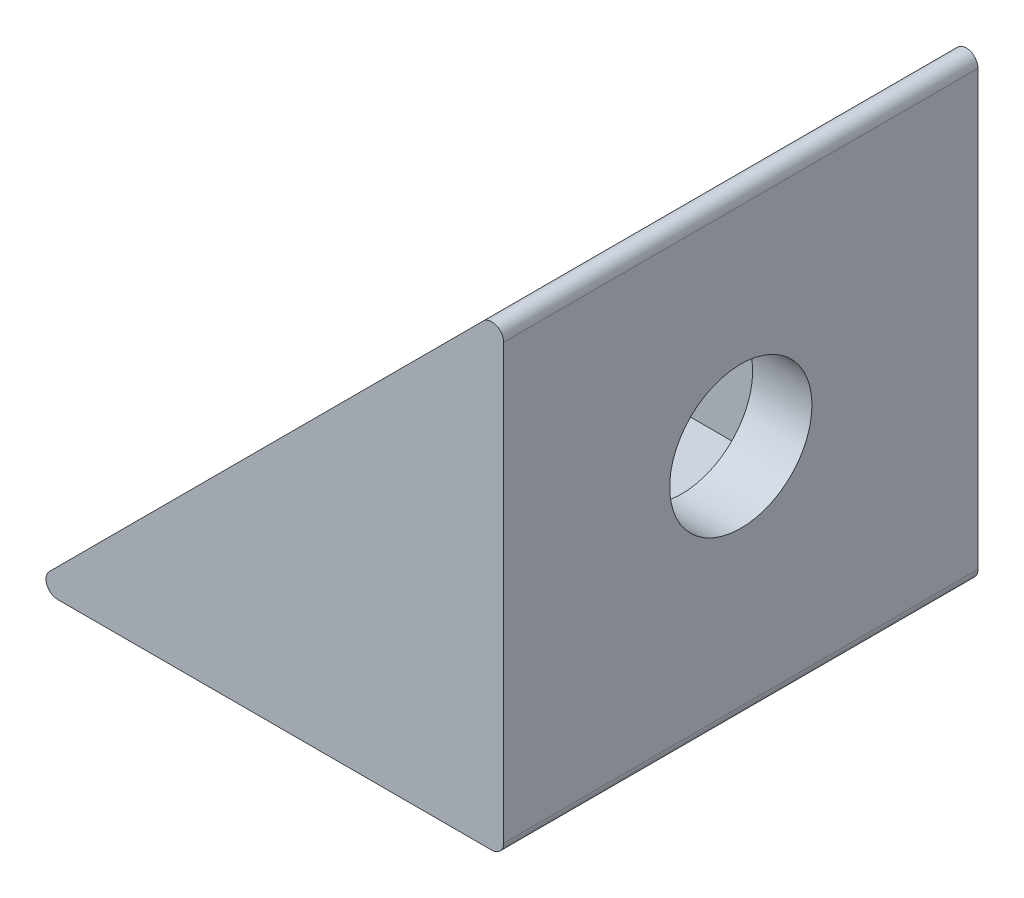
ISO-10303-21;
HEADER;
FILE_DESCRIPTION(('STEP AP214'),'2;1');
FILE_NAME('part.step','',(''),(''),'','','');
FILE_SCHEMA(('AUTOMOTIVE_DESIGN { 1 0 10303 214 1 1 1 1 }'));
ENDSEC;
DATA;
#1=APPLICATION_CONTEXT('core data for automotive mechanical design processes');
#2=APPLICATION_PROTOCOL_DEFINITION('international standard','automotive_design',2000,#1);
#3=PRODUCT_CONTEXT('',#1,'mechanical');
#4=PRODUCT('Part','Part','',(#3));
#5=PRODUCT_RELATED_PRODUCT_CATEGORY('part','',(#4));
#6=PRODUCT_DEFINITION_FORMATION('','',#4);
#7=PRODUCT_DEFINITION_CONTEXT('part definition',#1,'design');
#8=PRODUCT_DEFINITION('design','',#6,#7);
#9=PRODUCT_DEFINITION_SHAPE('','',#8);
#10=(LENGTH_UNIT() NAMED_UNIT(*) SI_UNIT(.MILLI.,.METRE.));
#11=(NAMED_UNIT(*) PLANE_ANGLE_UNIT() SI_UNIT($,.RADIAN.));
#12=(NAMED_UNIT(*) SI_UNIT($,.STERADIAN.) SOLID_ANGLE_UNIT());
#13=UNCERTAINTY_MEASURE_WITH_UNIT(LENGTH_MEASURE(1.E-05),#10,'distance_accuracy_value','');
#14=(GEOMETRIC_REPRESENTATION_CONTEXT(3) GLOBAL_UNCERTAINTY_ASSIGNED_CONTEXT((#13)) GLOBAL_UNIT_ASSIGNED_CONTEXT((#10,
#11,#12)) REPRESENTATION_CONTEXT('',''));
#15=CARTESIAN_POINT('',(0.,0.,0.));
#16=DIRECTION('',(0.,0.,1.));
#17=DIRECTION('',(1.,0.,0.));
#18=AXIS2_PLACEMENT_3D('',#15,#16,#17);
#19=CARTESIAN_POINT('',(0.,20.,0.));
#20=DIRECTION('',(0.,-1.,0.));
#21=DIRECTION('',(0.,0.,-1.));
#22=AXIS2_PLACEMENT_3D('',#19,#20,#21);
#23=CYLINDRICAL_SURFACE('',#22,3.);
#24=CARTESIAN_POINT('',(0.,0.,0.));
#25=DIRECTION('',(0.,-1.,0.));
#26=DIRECTION('',(0.,0.,-1.));
#27=AXIS2_PLACEMENT_3D('',#24,#25,#26);
#28=CIRCLE('',#27,3.);
#29=CARTESIAN_POINT('',(0.,0.,-3.));
#30=VERTEX_POINT('',#29);
#31=EDGE_CURVE('E142',#30,#30,#28,.T.);
#32=ORIENTED_EDGE('',*,*,#31,.T.);
#33=EDGE_LOOP('',(#32));
#34=FACE_BOUND('',#33,.T.);
#35=CARTESIAN_POINT('',(0.,2.5,0.));
#36=DIRECTION('',(0.,1.,0.));
#37=DIRECTION('',(0.,0.,1.));
#38=AXIS2_PLACEMENT_3D('',#35,#36,#37);
#39=CIRCLE('',#38,3.);
#40=CARTESIAN_POINT('',(0.,2.5,3.));
#41=VERTEX_POINT('',#40);
#42=EDGE_CURVE('E122',#41,#41,#39,.F.);
#43=ORIENTED_EDGE('',*,*,#42,.F.);
#44=EDGE_LOOP('',(#43));
#45=FACE_BOUND('',#44,.T.);
#46=ADVANCED_FACE('F38',(#34,#45),#23,.F.);
#47=CARTESIAN_POINT('',(10.,20.,-10.));
#48=DIRECTION('',(-1.,0.,0.));
#49=DIRECTION('',(0.,0.,1.));
#50=AXIS2_PLACEMENT_3D('',#47,#48,#49);
#51=PLANE('',#50);
#52=CARTESIAN_POINT('',(10.,10.,0.));
#53=DIRECTION('',(1.,0.,0.));
#54=DIRECTION('',(0.,0.,-1.));
#55=AXIS2_PLACEMENT_3D('',#52,#53,#54);
#56=CIRCLE('',#55,3.);
#57=CARTESIAN_POINT('',(10.,10.,-3.));
#58=VERTEX_POINT('',#57);
#59=EDGE_CURVE('E146',#58,#58,#56,.T.);
#60=ORIENTED_EDGE('',*,*,#59,.F.);
#61=EDGE_LOOP('',(#60));
#62=FACE_BOUND('',#61,.T.);
#63=DIRECTION('',(0.,-1.,0.));
#64=VECTOR('',#63,1.);
#65=CARTESIAN_POINT('',(10.,20.,10.));
#66=LINE('',#65,#64);
#67=CARTESIAN_POINT('',(10.,18.7928932188134,10.));
#68=VERTEX_POINT('',#67);
#69=CARTESIAN_POINT('',(10.,0.5,10.));
#70=VERTEX_POINT('',#69);
#71=EDGE_CURVE('E160',#68,#70,#66,.T.);
#72=ORIENTED_EDGE('',*,*,#71,.T.);
#73=DIRECTION('',(0.,0.,-1.));
#74=VECTOR('',#73,1.);
#75=CARTESIAN_POINT('',(10.,0.5,-10.));
#76=LINE('',#75,#74);
#77=CARTESIAN_POINT('',(10.,0.5,-10.));
#78=VERTEX_POINT('',#77);
#79=EDGE_CURVE('E176',#70,#78,#76,.T.);
#80=ORIENTED_EDGE('',*,*,#79,.T.);
#81=DIRECTION('',(0.,-1.,0.));
#82=VECTOR('',#81,1.);
#83=CARTESIAN_POINT('',(10.,20.,-10.));
#84=LINE('',#83,#82);
#85=CARTESIAN_POINT('',(10.,18.7928932188134,-10.));
#86=VERTEX_POINT('',#85);
#87=EDGE_CURVE('E163',#86,#78,#84,.T.);
#88=ORIENTED_EDGE('',*,*,#87,.F.);
#89=DIRECTION('',(0.,0.,-1.));
#90=VECTOR('',#89,1.);
#91=CARTESIAN_POINT('',(10.,18.7928932188134,-10.));
#92=LINE('',#91,#90);
#93=EDGE_CURVE('E174',#86,#68,#92,.F.);
#94=ORIENTED_EDGE('',*,*,#93,.T.);
#95=EDGE_LOOP('',(#72,#80,#88,#94));
#96=FACE_BOUND('',#95,.T.);
#97=ADVANCED_FACE('F210',(#62,#96),#51,.F.);
#98=CARTESIAN_POINT('',(-10.,20.,-10.));
#99=DIRECTION('',(0.,0.,1.));
#100=DIRECTION('',(1.,0.,0.));
#101=AXIS2_PLACEMENT_3D('',#98,#99,#100);
#102=PLANE('',#101);
#103=ORIENTED_EDGE('',*,*,#87,.T.);
#104=CARTESIAN_POINT('',(9.5,0.5,-10.));
#105=DIRECTION('',(0.,0.,1.));
#106=DIRECTION('',(1.,0.,0.));
#107=AXIS2_PLACEMENT_3D('',#104,#105,#106);
#108=CIRCLE('',#107,0.5);
#109=CARTESIAN_POINT('',(9.5,0.,-10.));
#110=VERTEX_POINT('',#109);
#111=EDGE_CURVE('E183',#78,#110,#108,.F.);
#112=ORIENTED_EDGE('',*,*,#111,.T.);
#113=DIRECTION('',(-1.,0.,0.));
#114=VECTOR('',#113,1.);
#115=CARTESIAN_POINT('',(-10.,0.,-10.));
#116=LINE('',#115,#114);
#117=CARTESIAN_POINT('',(-8.79289321881345,0.,-10.));
#118=VERTEX_POINT('',#117);
#119=EDGE_CURVE('E154',#110,#118,#116,.T.);
#120=ORIENTED_EDGE('',*,*,#119,.T.);
#121=CARTESIAN_POINT('',(-8.79289321881345,0.5,-10.));
#122=DIRECTION('',(0.,0.,1.));
#123=DIRECTION('',(1.,0.,0.));
#124=AXIS2_PLACEMENT_3D('',#121,#122,#123);
#125=CIRCLE('',#124,0.5);
#126=CARTESIAN_POINT('',(-9.14644660940673,0.853553390593275,-10.));
#127=VERTEX_POINT('',#126);
#128=EDGE_CURVE('E179',#118,#127,#125,.F.);
#129=ORIENTED_EDGE('',*,*,#128,.T.);
#130=DIRECTION('',(0.707106781186548,0.707106781186547,0.));
#131=VECTOR('',#130,1.);
#132=CARTESIAN_POINT('',(-10.,0.,-10.));
#133=LINE('',#132,#131);
#134=CARTESIAN_POINT('',(9.14644660940672,19.1464466094067,-10.));
#135=VERTEX_POINT('',#134);
#136=EDGE_CURVE('E149',#127,#135,#133,.T.);
#137=ORIENTED_EDGE('',*,*,#136,.T.);
#138=CARTESIAN_POINT('',(9.5,18.7928932188134,-10.));
#139=DIRECTION('',(0.,0.,1.));
#140=DIRECTION('',(1.,0.,0.));
#141=AXIS2_PLACEMENT_3D('',#138,#139,#140);
#142=CIRCLE('',#141,0.5);
#143=EDGE_CURVE('E181',#135,#86,#142,.F.);
#144=ORIENTED_EDGE('',*,*,#143,.T.);
#145=EDGE_LOOP('',(#103,#112,#120,#129,#137,#144));
#146=FACE_BOUND('',#145,.T.);
#147=ADVANCED_FACE('F205',(#146),#102,.F.);
#148=CARTESIAN_POINT('',(-10.,20.,10.));
#149=DIRECTION('',(0.,0.,-1.));
#150=DIRECTION('',(-1.,0.,0.));
#151=AXIS2_PLACEMENT_3D('',#148,#149,#150);
#152=PLANE('',#151);
#153=DIRECTION('',(1.,0.,0.));
#154=VECTOR('',#153,1.);
#155=CARTESIAN_POINT('',(-10.,0.,10.));
#156=LINE('',#155,#154);
#157=CARTESIAN_POINT('',(-8.79289321881345,0.,10.));
#158=VERTEX_POINT('',#157);
#159=CARTESIAN_POINT('',(9.5,0.,10.));
#160=VERTEX_POINT('',#159);
#161=EDGE_CURVE('E157',#158,#160,#156,.T.);
#162=ORIENTED_EDGE('',*,*,#161,.T.);
#163=CARTESIAN_POINT('',(9.5,0.5,10.));
#164=DIRECTION('',(0.,0.,-1.));
#165=DIRECTION('',(-1.,0.,0.));
#166=AXIS2_PLACEMENT_3D('',#163,#164,#165);
#167=CIRCLE('',#166,0.5);
#168=EDGE_CURVE('E191',#160,#70,#167,.F.);
#169=ORIENTED_EDGE('',*,*,#168,.T.);
#170=ORIENTED_EDGE('',*,*,#71,.F.);
#171=CARTESIAN_POINT('',(9.5,18.7928932188134,10.));
#172=DIRECTION('',(0.,0.,-1.));
#173=DIRECTION('',(-1.,0.,0.));
#174=AXIS2_PLACEMENT_3D('',#171,#172,#173);
#175=CIRCLE('',#174,0.5);
#176=CARTESIAN_POINT('',(9.14644660940673,19.1464466094067,10.));
#177=VERTEX_POINT('',#176);
#178=EDGE_CURVE('E61',#68,#177,#175,.F.);
#179=ORIENTED_EDGE('',*,*,#178,.T.);
#180=DIRECTION('',(-0.707106781186548,-0.707106781186547,0.));
#181=VECTOR('',#180,1.);
#182=CARTESIAN_POINT('',(0.,10.,10.));
#183=LINE('',#182,#181);
#184=CARTESIAN_POINT('',(-9.14644660940673,0.853553390593275,10.));
#185=VERTEX_POINT('',#184);
#186=EDGE_CURVE('E152',#177,#185,#183,.T.);
#187=ORIENTED_EDGE('',*,*,#186,.T.);
#188=CARTESIAN_POINT('',(-8.79289321881345,0.5,10.));
#189=DIRECTION('',(0.,0.,-1.));
#190=DIRECTION('',(-1.,0.,0.));
#191=AXIS2_PLACEMENT_3D('',#188,#189,#190);
#192=CIRCLE('',#191,0.5);
#193=EDGE_CURVE('E53',#185,#158,#192,.F.);
#194=ORIENTED_EDGE('',*,*,#193,.T.);
#195=EDGE_LOOP('',(#162,#169,#170,#179,#187,#194));
#196=FACE_BOUND('',#195,.T.);
#197=ADVANCED_FACE('F197',(#196),#152,.F.);
#198=CARTESIAN_POINT('',(0.,0.,0.));
#199=DIRECTION('',(0.,1.,0.));
#200=DIRECTION('',(0.,0.,1.));
#201=AXIS2_PLACEMENT_3D('',#198,#199,#200);
#202=PLANE('',#201);
#203=ORIENTED_EDGE('',*,*,#31,.F.);
#204=EDGE_LOOP('',(#203));
#205=FACE_BOUND('',#204,.T.);
#206=ORIENTED_EDGE('',*,*,#119,.F.);
#207=DIRECTION('',(0.,0.,-1.));
#208=VECTOR('',#207,1.);
#209=CARTESIAN_POINT('',(9.5,0.,0.));
#210=LINE('',#209,#208);
#211=EDGE_CURVE('E187',#110,#160,#210,.F.);
#212=ORIENTED_EDGE('',*,*,#211,.T.);
#213=ORIENTED_EDGE('',*,*,#161,.F.);
#214=DIRECTION('',(0.,0.,1.));
#215=VECTOR('',#214,1.);
#216=CARTESIAN_POINT('',(-8.79289321881345,0.,0.));
#217=LINE('',#216,#215);
#218=EDGE_CURVE('E185',#158,#118,#217,.F.);
#219=ORIENTED_EDGE('',*,*,#218,.T.);
#220=EDGE_LOOP('',(#206,#212,#213,#219));
#221=FACE_BOUND('',#220,.T.);
#222=ADVANCED_FACE('F202',(#205,#221),#202,.F.);
#223=CARTESIAN_POINT('',(-10.,0.,-10.));
#224=DIRECTION('',(0.707106781186547,-0.707106781186548,0.));
#225=DIRECTION('',(0.707106781186548,0.707106781186547,0.));
#226=AXIS2_PLACEMENT_3D('',#223,#224,#225);
#227=PLANE('',#226);
#228=DIRECTION('',(0.,0.,1.));
#229=VECTOR('',#228,1.);
#230=CARTESIAN_POINT('',(7.5,17.5,-10.));
#231=LINE('',#230,#229);
#232=CARTESIAN_POINT('',(7.5,17.5,-7.5));
#233=VERTEX_POINT('',#232);
#234=CARTESIAN_POINT('',(7.5,17.5,7.5));
#235=VERTEX_POINT('',#234);
#236=EDGE_CURVE('E135',#233,#235,#231,.T.);
#237=ORIENTED_EDGE('',*,*,#236,.T.);
#238=DIRECTION('',(-0.707106781186548,-0.707106781186547,0.));
#239=VECTOR('',#238,1.);
#240=CARTESIAN_POINT('',(-10.,0.,7.5));
#241=LINE('',#240,#239);
#242=CARTESIAN_POINT('',(-7.5,2.5,7.5));
#243=VERTEX_POINT('',#242);
#244=EDGE_CURVE('E171',#235,#243,#241,.T.);
#245=ORIENTED_EDGE('',*,*,#244,.T.);
#246=DIRECTION('',(0.,0.,-1.));
#247=VECTOR('',#246,1.);
#248=CARTESIAN_POINT('',(-7.5,2.5,7.5));
#249=LINE('',#248,#247);
#250=CARTESIAN_POINT('',(-7.5,2.5,-7.5));
#251=VERTEX_POINT('',#250);
#252=EDGE_CURVE('E138',#243,#251,#249,.T.);
#253=ORIENTED_EDGE('',*,*,#252,.T.);
#254=DIRECTION('',(0.707106781186548,0.707106781186547,0.));
#255=VECTOR('',#254,1.);
#256=CARTESIAN_POINT('',(-10.,0.,-7.5));
#257=LINE('',#256,#255);
#258=EDGE_CURVE('E118',#251,#233,#257,.T.);
#259=ORIENTED_EDGE('',*,*,#258,.T.);
#260=EDGE_LOOP('',(#237,#245,#253,#259));
#261=FACE_BOUND('',#260,.T.);
#262=ORIENTED_EDGE('',*,*,#186,.F.);
#263=DIRECTION('',(0.,0.,-1.));
#264=VECTOR('',#263,1.);
#265=CARTESIAN_POINT('',(9.14644660940672,19.1464466094067,-10.));
#266=LINE('',#265,#264);
#267=EDGE_CURVE('E12',#177,#135,#266,.T.);
#268=ORIENTED_EDGE('',*,*,#267,.T.);
#269=ORIENTED_EDGE('',*,*,#136,.F.);
#270=DIRECTION('',(0.,0.,1.));
#271=VECTOR('',#270,1.);
#272=CARTESIAN_POINT('',(-9.14644660940673,0.853553390593274,-10.));
#273=LINE('',#272,#271);
#274=EDGE_CURVE('E46',#127,#185,#273,.T.);
#275=ORIENTED_EDGE('',*,*,#274,.T.);
#276=EDGE_LOOP('',(#262,#268,#269,#275));
#277=FACE_BOUND('',#276,.T.);
#278=ADVANCED_FACE('F194',(#261,#277),#227,.F.);
#279=CARTESIAN_POINT('',(-10.,10.,0.));
#280=DIRECTION('',(1.,0.,0.));
#281=DIRECTION('',(0.,0.,-1.));
#282=AXIS2_PLACEMENT_3D('',#279,#280,#281);
#283=CYLINDRICAL_SURFACE('',#282,3.);
#284=CARTESIAN_POINT('',(7.5,10.,0.));
#285=DIRECTION('',(1.,0.,0.));
#286=DIRECTION('',(0.,0.,-1.));
#287=AXIS2_PLACEMENT_3D('',#284,#285,#286);
#288=CIRCLE('',#287,3.);
#289=CARTESIAN_POINT('',(7.5,10.,-3.));
#290=VERTEX_POINT('',#289);
#291=EDGE_CURVE('E143',#290,#290,#288,.F.);
#292=ORIENTED_EDGE('',*,*,#291,.T.);
#293=EDGE_LOOP('',(#292));
#294=FACE_BOUND('',#293,.T.);
#295=ORIENTED_EDGE('',*,*,#59,.T.);
#296=EDGE_LOOP('',(#295));
#297=FACE_BOUND('',#296,.T.);
#298=ADVANCED_FACE('F233',(#294,#297),#283,.F.);
#299=CARTESIAN_POINT('',(-7.5,-21.2132034355964,7.5));
#300=DIRECTION('',(0.,0.,1.));
#301=DIRECTION('',(1.,0.,0.));
#302=AXIS2_PLACEMENT_3D('',#299,#300,#301);
#303=PLANE('',#302);
#304=DIRECTION('',(0.,1.,0.));
#305=VECTOR('',#304,1.);
#306=CARTESIAN_POINT('',(7.5,-21.2132034355964,7.5));
#307=LINE('',#306,#305);
#308=CARTESIAN_POINT('',(7.5,2.5,7.5));
#309=VERTEX_POINT('',#308);
#310=EDGE_CURVE('E136',#309,#235,#307,.T.);
#311=ORIENTED_EDGE('',*,*,#310,.F.);
#312=DIRECTION('',(-1.,0.,0.));
#313=VECTOR('',#312,1.);
#314=CARTESIAN_POINT('',(-7.5,2.5,7.5));
#315=LINE('',#314,#313);
#316=EDGE_CURVE('E128',#309,#243,#315,.T.);
#317=ORIENTED_EDGE('',*,*,#316,.T.);
#318=ORIENTED_EDGE('',*,*,#244,.F.);
#319=EDGE_LOOP('',(#311,#317,#318));
#320=FACE_BOUND('',#319,.T.);
#321=ADVANCED_FACE('F236',(#320),#303,.F.);
#322=CARTESIAN_POINT('',(-7.5,-21.2132034355964,-7.5));
#323=DIRECTION('',(0.,0.,-1.));
#324=DIRECTION('',(-1.,0.,0.));
#325=AXIS2_PLACEMENT_3D('',#322,#323,#324);
#326=PLANE('',#325);
#327=DIRECTION('',(1.,0.,0.));
#328=VECTOR('',#327,1.);
#329=CARTESIAN_POINT('',(-7.5,2.5,-7.5));
#330=LINE('',#329,#328);
#331=CARTESIAN_POINT('',(7.5,2.5,-7.5));
#332=VERTEX_POINT('',#331);
#333=EDGE_CURVE('E112',#251,#332,#330,.T.);
#334=ORIENTED_EDGE('',*,*,#333,.T.);
#335=DIRECTION('',(0.,1.,0.));
#336=VECTOR('',#335,1.);
#337=CARTESIAN_POINT('',(7.5,-21.2132034355964,-7.5));
#338=LINE('',#337,#336);
#339=EDGE_CURVE('E116',#332,#233,#338,.T.);
#340=ORIENTED_EDGE('',*,*,#339,.T.);
#341=ORIENTED_EDGE('',*,*,#258,.F.);
#342=EDGE_LOOP('',(#334,#340,#341));
#343=FACE_BOUND('',#342,.T.);
#344=ADVANCED_FACE('F114',(#343),#326,.F.);
#345=CARTESIAN_POINT('',(7.5,-21.2132034355964,7.5));
#346=DIRECTION('',(1.,0.,0.));
#347=DIRECTION('',(0.,0.,-1.));
#348=AXIS2_PLACEMENT_3D('',#345,#346,#347);
#349=PLANE('',#348);
#350=ORIENTED_EDGE('',*,*,#291,.F.);
#351=EDGE_LOOP('',(#350));
#352=FACE_BOUND('',#351,.T.);
#353=ORIENTED_EDGE('',*,*,#339,.F.);
#354=DIRECTION('',(0.,0.,1.));
#355=VECTOR('',#354,1.);
#356=CARTESIAN_POINT('',(7.5,2.5,7.5));
#357=LINE('',#356,#355);
#358=EDGE_CURVE('E123',#332,#309,#357,.T.);
#359=ORIENTED_EDGE('',*,*,#358,.T.);
#360=ORIENTED_EDGE('',*,*,#310,.T.);
#361=ORIENTED_EDGE('',*,*,#236,.F.);
#362=EDGE_LOOP('',(#353,#359,#360,#361));
#363=FACE_BOUND('',#362,.T.);
#364=ADVANCED_FACE('F133',(#352,#363),#349,.F.);
#365=CARTESIAN_POINT('',(0.,2.5,0.));
#366=DIRECTION('',(0.,1.,0.));
#367=DIRECTION('',(0.,0.,1.));
#368=AXIS2_PLACEMENT_3D('',#365,#366,#367);
#369=PLANE('',#368);
#370=ORIENTED_EDGE('',*,*,#358,.F.);
#371=ORIENTED_EDGE('',*,*,#333,.F.);
#372=ORIENTED_EDGE('',*,*,#252,.F.);
#373=ORIENTED_EDGE('',*,*,#316,.F.);
#374=EDGE_LOOP('',(#370,#371,#372,#373));
#375=FACE_BOUND('',#374,.T.);
#376=ORIENTED_EDGE('',*,*,#42,.T.);
#377=EDGE_LOOP('',(#376));
#378=FACE_BOUND('',#377,.T.);
#379=ADVANCED_FACE('F126',(#375,#378),#369,.T.);
#380=CARTESIAN_POINT('',(9.5,0.5,-10.));
#381=DIRECTION('',(0.,0.,-1.));
#382=DIRECTION('',(-1.,0.,0.));
#383=AXIS2_PLACEMENT_3D('',#380,#381,#382);
#384=CYLINDRICAL_SURFACE('',#383,0.5);
#385=ORIENTED_EDGE('',*,*,#168,.F.);
#386=ORIENTED_EDGE('',*,*,#211,.F.);
#387=ORIENTED_EDGE('',*,*,#111,.F.);
#388=ORIENTED_EDGE('',*,*,#79,.F.);
#389=EDGE_LOOP('',(#385,#386,#387,#388));
#390=FACE_BOUND('',#389,.T.);
#391=ADVANCED_FACE('F207',(#390),#384,.T.);
#392=CARTESIAN_POINT('',(9.5,18.7928932188134,-10.));
#393=DIRECTION('',(0.,0.,-1.));
#394=DIRECTION('',(-1.,0.,0.));
#395=AXIS2_PLACEMENT_3D('',#392,#393,#394);
#396=CYLINDRICAL_SURFACE('',#395,0.5);
#397=ORIENTED_EDGE('',*,*,#178,.F.);
#398=ORIENTED_EDGE('',*,*,#93,.F.);
#399=ORIENTED_EDGE('',*,*,#143,.F.);
#400=ORIENTED_EDGE('',*,*,#267,.F.);
#401=EDGE_LOOP('',(#397,#398,#399,#400));
#402=FACE_BOUND('',#401,.T.);
#403=ADVANCED_FACE('F214',(#402),#396,.T.);
#404=CARTESIAN_POINT('',(-8.79289321881345,0.5,-10.));
#405=DIRECTION('',(0.,0.,1.));
#406=DIRECTION('',(1.,0.,0.));
#407=AXIS2_PLACEMENT_3D('',#404,#405,#406);
#408=CYLINDRICAL_SURFACE('',#407,0.5);
#409=ORIENTED_EDGE('',*,*,#128,.F.);
#410=ORIENTED_EDGE('',*,*,#218,.F.);
#411=ORIENTED_EDGE('',*,*,#193,.F.);
#412=ORIENTED_EDGE('',*,*,#274,.F.);
#413=EDGE_LOOP('',(#409,#410,#411,#412));
#414=FACE_BOUND('',#413,.T.);
#415=ADVANCED_FACE('F40',(#414),#408,.T.);
#416=CLOSED_SHELL('',(#46,#97,#147,#197,#222,#278,#298,#321,#344,#364,#379,#391,#403,#415));
#417=MANIFOLD_SOLID_BREP('B2',#416);
#418=ADVANCED_BREP_SHAPE_REPRESENTATION('',(#18,#417),#14);
#419=SHAPE_DEFINITION_REPRESENTATION(#9,#418);
ENDSEC;
END-ISO-10303-21;
